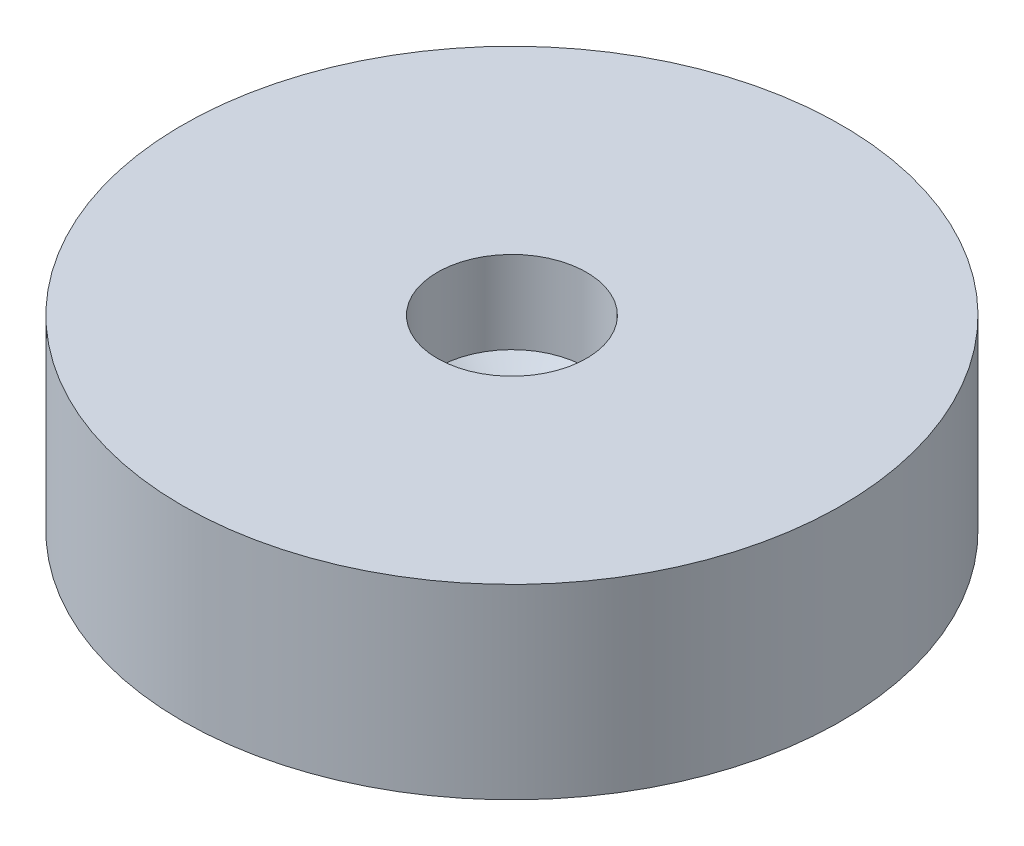
ISO-10303-21;
HEADER;
FILE_DESCRIPTION(('STEP AP214'),'2;1');
FILE_NAME('part.step','',(''),(''),'','','');
FILE_SCHEMA(('AUTOMOTIVE_DESIGN { 1 0 10303 214 1 1 1 1 }'));
ENDSEC;
DATA;
#1=APPLICATION_CONTEXT('core data for automotive mechanical design processes');
#2=APPLICATION_PROTOCOL_DEFINITION('international standard','automotive_design',2000,#1);
#3=PRODUCT_CONTEXT('',#1,'mechanical');
#4=PRODUCT('Part','Part','',(#3));
#5=PRODUCT_RELATED_PRODUCT_CATEGORY('part','',(#4));
#6=PRODUCT_DEFINITION_FORMATION('','',#4);
#7=PRODUCT_DEFINITION_CONTEXT('part definition',#1,'design');
#8=PRODUCT_DEFINITION('design','',#6,#7);
#9=PRODUCT_DEFINITION_SHAPE('','',#8);
#10=(LENGTH_UNIT() NAMED_UNIT(*) SI_UNIT(.MILLI.,.METRE.));
#11=(NAMED_UNIT(*) PLANE_ANGLE_UNIT() SI_UNIT($,.RADIAN.));
#12=(NAMED_UNIT(*) SI_UNIT($,.STERADIAN.) SOLID_ANGLE_UNIT());
#13=UNCERTAINTY_MEASURE_WITH_UNIT(LENGTH_MEASURE(1.E-05),#10,'distance_accuracy_value','');
#14=(GEOMETRIC_REPRESENTATION_CONTEXT(3) GLOBAL_UNCERTAINTY_ASSIGNED_CONTEXT((#13)) GLOBAL_UNIT_ASSIGNED_CONTEXT((#10,
#11,#12)) REPRESENTATION_CONTEXT('',''));
#15=CARTESIAN_POINT('',(0.,0.,0.));
#16=DIRECTION('',(0.,0.,1.));
#17=DIRECTION('',(1.,0.,0.));
#18=AXIS2_PLACEMENT_3D('',#15,#16,#17);
#19=CARTESIAN_POINT('',(22.,0.,0.));
#20=DIRECTION('',(0.,1.,0.));
#21=DIRECTION('',(0.,0.,1.));
#22=AXIS2_PLACEMENT_3D('',#19,#20,#21);
#23=PLANE('',#22);
#24=CARTESIAN_POINT('',(0.,0.,0.));
#25=DIRECTION('',(0.,1.,0.));
#26=DIRECTION('',(0.,0.,1.));
#27=AXIS2_PLACEMENT_3D('',#24,#25,#26);
#28=CIRCLE('',#27,26.5);
#29=CARTESIAN_POINT('',(0.,0.,26.5));
#30=VERTEX_POINT('',#29);
#31=EDGE_CURVE('E58',#30,#30,#28,.T.);
#32=ORIENTED_EDGE('',*,*,#31,.F.);
#33=EDGE_LOOP('',(#32));
#34=FACE_BOUND('',#33,.T.);
#35=CARTESIAN_POINT('',(0.,0.,0.));
#36=DIRECTION('',(0.,1.,0.));
#37=DIRECTION('',(0.,0.,1.));
#38=AXIS2_PLACEMENT_3D('',#35,#36,#37);
#39=CIRCLE('',#38,22.);
#40=CARTESIAN_POINT('',(0.,0.,22.));
#41=VERTEX_POINT('',#40);
#42=EDGE_CURVE('E10',#41,#41,#39,.T.);
#43=ORIENTED_EDGE('',*,*,#42,.T.);
#44=EDGE_LOOP('',(#43));
#45=FACE_BOUND('',#44,.T.);
#46=ADVANCED_FACE('F33',(#34,#45),#23,.F.);
#47=CARTESIAN_POINT('',(0.,5.44285714285714,0.));
#48=DIRECTION('',(0.,-1.,0.));
#49=DIRECTION('',(0.,0.,-1.));
#50=AXIS2_PLACEMENT_3D('',#47,#48,#49);
#51=CONICAL_SURFACE('',#50,3.25,1.28827537520932);
#52=ORIENTED_EDGE('',*,*,#42,.F.);
#53=EDGE_LOOP('',(#52));
#54=FACE_BOUND('',#53,.T.);
#55=CARTESIAN_POINT('',(0.,5.44285714285714,0.));
#56=DIRECTION('',(0.,1.,0.));
#57=DIRECTION('',(0.,0.,1.));
#58=AXIS2_PLACEMENT_3D('',#55,#56,#57);
#59=CIRCLE('',#58,3.25);
#60=CARTESIAN_POINT('',(0.,5.44285714285714,3.25));
#61=VERTEX_POINT('',#60);
#62=EDGE_CURVE('E39',#61,#61,#59,.T.);
#63=ORIENTED_EDGE('',*,*,#62,.T.);
#64=EDGE_LOOP('',(#63));
#65=FACE_BOUND('',#64,.T.);
#66=ADVANCED_FACE('F65',(#54,#65),#51,.F.);
#67=CARTESIAN_POINT('',(0.,0.,0.));
#68=DIRECTION('',(0.,1.,0.));
#69=DIRECTION('',(0.,0.,1.));
#70=AXIS2_PLACEMENT_3D('',#67,#68,#69);
#71=CYLINDRICAL_SURFACE('',#70,3.25);
#72=ORIENTED_EDGE('',*,*,#62,.F.);
#73=EDGE_LOOP('',(#72));
#74=FACE_BOUND('',#73,.T.);
#75=CARTESIAN_POINT('',(0.,6.44285714285714,0.));
#76=DIRECTION('',(0.,1.,0.));
#77=DIRECTION('',(0.,0.,1.));
#78=AXIS2_PLACEMENT_3D('',#75,#76,#77);
#79=CIRCLE('',#78,3.25);
#80=CARTESIAN_POINT('',(0.,6.44285714285714,3.25));
#81=VERTEX_POINT('',#80);
#82=EDGE_CURVE('E43',#81,#81,#79,.T.);
#83=ORIENTED_EDGE('',*,*,#82,.T.);
#84=EDGE_LOOP('',(#83));
#85=FACE_BOUND('',#84,.T.);
#86=ADVANCED_FACE('F69',(#74,#85),#71,.F.);
#87=CARTESIAN_POINT('',(0.,8.36842787293385,0.));
#88=DIRECTION('',(0.,1.,0.));
#89=DIRECTION('',(0.,0.,1.));
#90=AXIS2_PLACEMENT_3D('',#87,#88,#89);
#91=CONICAL_SURFACE('',#90,6.,0.95993108859688);
#92=ORIENTED_EDGE('',*,*,#82,.F.);
#93=EDGE_LOOP('',(#92));
#94=FACE_BOUND('',#93,.T.);
#95=CARTESIAN_POINT('',(0.,8.36842787293385,0.));
#96=DIRECTION('',(0.,1.,0.));
#97=DIRECTION('',(0.,0.,1.));
#98=AXIS2_PLACEMENT_3D('',#95,#96,#97);
#99=CIRCLE('',#98,6.);
#100=CARTESIAN_POINT('',(0.,8.36842787293385,6.));
#101=VERTEX_POINT('',#100);
#102=EDGE_CURVE('E47',#101,#101,#99,.T.);
#103=ORIENTED_EDGE('',*,*,#102,.T.);
#104=EDGE_LOOP('',(#103));
#105=FACE_BOUND('',#104,.T.);
#106=ADVANCED_FACE('F74',(#94,#105),#91,.F.);
#107=CARTESIAN_POINT('',(0.,0.,0.));
#108=DIRECTION('',(0.,1.,0.));
#109=DIRECTION('',(0.,0.,1.));
#110=AXIS2_PLACEMENT_3D('',#107,#108,#109);
#111=CYLINDRICAL_SURFACE('',#110,6.);
#112=ORIENTED_EDGE('',*,*,#102,.F.);
#113=EDGE_LOOP('',(#112));
#114=FACE_BOUND('',#113,.T.);
#115=CARTESIAN_POINT('',(0.,15.,0.));
#116=DIRECTION('',(0.,1.,0.));
#117=DIRECTION('',(0.,0.,1.));
#118=AXIS2_PLACEMENT_3D('',#115,#116,#117);
#119=CIRCLE('',#118,6.);
#120=CARTESIAN_POINT('',(0.,15.,6.));
#121=VERTEX_POINT('',#120);
#122=EDGE_CURVE('E52',#121,#121,#119,.T.);
#123=ORIENTED_EDGE('',*,*,#122,.T.);
#124=EDGE_LOOP('',(#123));
#125=FACE_BOUND('',#124,.T.);
#126=ADVANCED_FACE('F80',(#114,#125),#111,.F.);
#127=CARTESIAN_POINT('',(26.5,15.,0.));
#128=DIRECTION('',(0.,-1.,0.));
#129=DIRECTION('',(0.,0.,-1.));
#130=AXIS2_PLACEMENT_3D('',#127,#128,#129);
#131=PLANE('',#130);
#132=ORIENTED_EDGE('',*,*,#122,.F.);
#133=EDGE_LOOP('',(#132));
#134=FACE_BOUND('',#133,.T.);
#135=CARTESIAN_POINT('',(0.,15.,0.));
#136=DIRECTION('',(0.,1.,0.));
#137=DIRECTION('',(0.,0.,1.));
#138=AXIS2_PLACEMENT_3D('',#135,#136,#137);
#139=CIRCLE('',#138,26.5);
#140=CARTESIAN_POINT('',(0.,15.,26.5));
#141=VERTEX_POINT('',#140);
#142=EDGE_CURVE('E55',#141,#141,#139,.T.);
#143=ORIENTED_EDGE('',*,*,#142,.T.);
#144=EDGE_LOOP('',(#143));
#145=FACE_BOUND('',#144,.T.);
#146=ADVANCED_FACE('F84',(#134,#145),#131,.F.);
#147=CARTESIAN_POINT('',(0.,0.,0.));
#148=DIRECTION('',(0.,1.,0.));
#149=DIRECTION('',(0.,0.,1.));
#150=AXIS2_PLACEMENT_3D('',#147,#148,#149);
#151=CYLINDRICAL_SURFACE('',#150,26.5);
#152=ORIENTED_EDGE('',*,*,#142,.F.);
#153=EDGE_LOOP('',(#152));
#154=FACE_BOUND('',#153,.T.);
#155=ORIENTED_EDGE('',*,*,#31,.T.);
#156=EDGE_LOOP('',(#155));
#157=FACE_BOUND('',#156,.T.);
#158=ADVANCED_FACE('F62',(#154,#157),#151,.T.);
#159=CLOSED_SHELL('',(#46,#66,#86,#106,#126,#146,#158));
#160=MANIFOLD_SOLID_BREP('B2',#159);
#161=ADVANCED_BREP_SHAPE_REPRESENTATION('',(#18,#160),#14);
#162=SHAPE_DEFINITION_REPRESENTATION(#9,#161);
ENDSEC;
END-ISO-10303-21;
